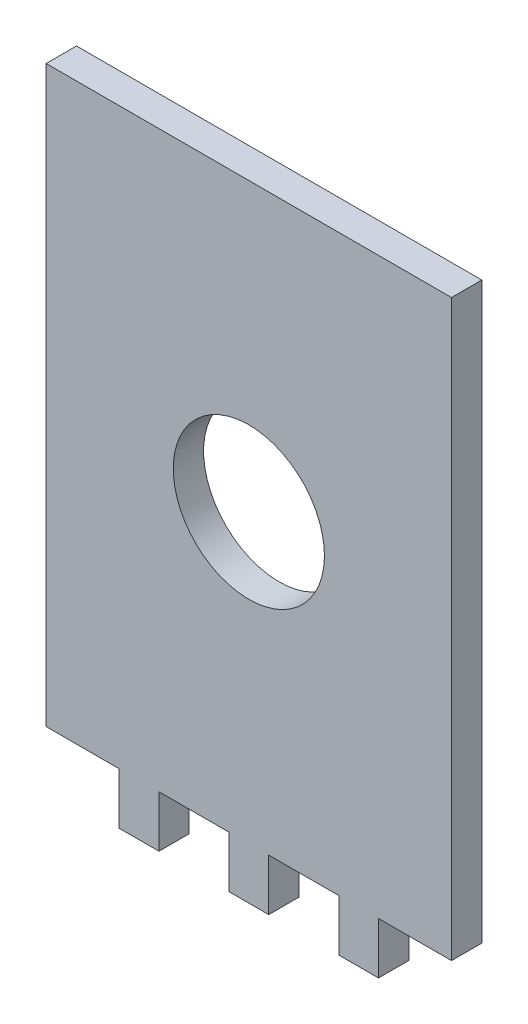
ISO-10303-21;
HEADER;
FILE_DESCRIPTION(('STEP AP214'),'2;1');
FILE_NAME('part.step','',(''),(''),'','','');
FILE_SCHEMA(('AUTOMOTIVE_DESIGN { 1 0 10303 214 1 1 1 1 }'));
ENDSEC;
DATA;
#1=APPLICATION_CONTEXT('core data for automotive mechanical design processes');
#2=APPLICATION_PROTOCOL_DEFINITION('international standard','automotive_design',2000,#1);
#3=PRODUCT_CONTEXT('',#1,'mechanical');
#4=PRODUCT('Part','Part','',(#3));
#5=PRODUCT_RELATED_PRODUCT_CATEGORY('part','',(#4));
#6=PRODUCT_DEFINITION_FORMATION('','',#4);
#7=PRODUCT_DEFINITION_CONTEXT('part definition',#1,'design');
#8=PRODUCT_DEFINITION('design','',#6,#7);
#9=PRODUCT_DEFINITION_SHAPE('','',#8);
#10=(LENGTH_UNIT() NAMED_UNIT(*) SI_UNIT(.MILLI.,.METRE.));
#11=(NAMED_UNIT(*) PLANE_ANGLE_UNIT() SI_UNIT($,.RADIAN.));
#12=(NAMED_UNIT(*) SI_UNIT($,.STERADIAN.) SOLID_ANGLE_UNIT());
#13=UNCERTAINTY_MEASURE_WITH_UNIT(LENGTH_MEASURE(1.E-05),#10,'distance_accuracy_value','');
#14=(GEOMETRIC_REPRESENTATION_CONTEXT(3) GLOBAL_UNCERTAINTY_ASSIGNED_CONTEXT((#13)) GLOBAL_UNIT_ASSIGNED_CONTEXT((#10,
#11,#12)) REPRESENTATION_CONTEXT('',''));
#15=CARTESIAN_POINT('',(0.,0.,0.));
#16=DIRECTION('',(0.,0.,1.));
#17=DIRECTION('',(1.,0.,0.));
#18=AXIS2_PLACEMENT_3D('',#15,#16,#17);
#19=CARTESIAN_POINT('',(0.,0.,-78.1122159172763));
#20=DIRECTION('',(0.,0.,1.));
#21=DIRECTION('',(1.,0.,0.));
#22=AXIS2_PLACEMENT_3D('',#19,#20,#21);
#23=CYLINDRICAL_SURFACE('',#22,7.91872);
#24=CARTESIAN_POINT('',(0.,0.,0.));
#25=DIRECTION('',(0.,0.,1.));
#26=DIRECTION('',(1.,0.,0.));
#27=AXIS2_PLACEMENT_3D('',#24,#25,#26);
#28=CIRCLE('',#27,7.91872);
#29=CARTESIAN_POINT('',(7.91872,0.,0.));
#30=VERTEX_POINT('',#29);
#31=EDGE_CURVE('E11',#30,#30,#28,.F.);
#32=ORIENTED_EDGE('',*,*,#31,.T.);
#33=EDGE_LOOP('',(#32));
#34=FACE_BOUND('',#33,.T.);
#35=CARTESIAN_POINT('',(0.,0.,3.175));
#36=DIRECTION('',(0.,0.,1.));
#37=DIRECTION('',(1.,0.,0.));
#38=AXIS2_PLACEMENT_3D('',#35,#36,#37);
#39=CIRCLE('',#38,7.91872);
#40=CARTESIAN_POINT('',(7.91872,0.,3.175));
#41=VERTEX_POINT('',#40);
#42=EDGE_CURVE('E186',#41,#41,#39,.T.);
#43=ORIENTED_EDGE('',*,*,#42,.T.);
#44=EDGE_LOOP('',(#43));
#45=FACE_BOUND('',#44,.T.);
#46=ADVANCED_FACE('F43',(#34,#45),#23,.F.);
#47=CARTESIAN_POINT('',(0.,0.,0.));
#48=DIRECTION('',(0.,0.,1.));
#49=DIRECTION('',(1.,0.,0.));
#50=AXIS2_PLACEMENT_3D('',#47,#48,#49);
#51=PLANE('',#50);
#52=DIRECTION('',(1.,0.,0.));
#53=VECTOR('',#52,1.);
#54=CARTESIAN_POINT('',(21.23128,30.08128,0.));
#55=LINE('',#54,#53);
#56=CARTESIAN_POINT('',(-21.23128,30.08128,0.));
#57=VERTEX_POINT('',#56);
#58=CARTESIAN_POINT('',(21.23128,30.08128,0.));
#59=VERTEX_POINT('',#58);
#60=EDGE_CURVE('E61',#57,#59,#55,.T.);
#61=ORIENTED_EDGE('',*,*,#60,.T.);
#62=DIRECTION('',(0.,-1.,0.));
#63=VECTOR('',#62,1.);
#64=CARTESIAN_POINT('',(21.23128,-30.08128,0.));
#65=LINE('',#64,#63);
#66=CARTESIAN_POINT('',(21.23128,-30.08128,0.));
#67=VERTEX_POINT('',#66);
#68=EDGE_CURVE('E323',#59,#67,#65,.T.);
#69=ORIENTED_EDGE('',*,*,#68,.T.);
#70=DIRECTION('',(-1.,0.,0.));
#71=VECTOR('',#70,1.);
#72=CARTESIAN_POINT('',(13.58128,-30.08128,0.));
#73=LINE('',#72,#71);
#74=CARTESIAN_POINT('',(13.58128,-30.08128,0.));
#75=VERTEX_POINT('',#74);
#76=EDGE_CURVE('E320',#67,#75,#73,.T.);
#77=ORIENTED_EDGE('',*,*,#76,.T.);
#78=DIRECTION('',(0.,-1.,0.));
#79=VECTOR('',#78,1.);
#80=CARTESIAN_POINT('',(13.5812799999999,-35.48128,0.));
#81=LINE('',#80,#79);
#82=CARTESIAN_POINT('',(13.5812799999999,-35.48128,0.));
#83=VERTEX_POINT('',#82);
#84=EDGE_CURVE('E317',#75,#83,#81,.T.);
#85=ORIENTED_EDGE('',*,*,#84,.T.);
#86=DIRECTION('',(-1.,0.,0.));
#87=VECTOR('',#86,1.);
#88=CARTESIAN_POINT('',(9.41871999999995,-35.48128,0.));
#89=LINE('',#88,#87);
#90=CARTESIAN_POINT('',(9.41871999999995,-35.48128,0.));
#91=VERTEX_POINT('',#90);
#92=EDGE_CURVE('E314',#83,#91,#89,.T.);
#93=ORIENTED_EDGE('',*,*,#92,.T.);
#94=DIRECTION('',(0.,1.,0.));
#95=VECTOR('',#94,1.);
#96=CARTESIAN_POINT('',(9.41871999999995,-30.08128,0.));
#97=LINE('',#96,#95);
#98=CARTESIAN_POINT('',(9.41871999999995,-30.08128,0.));
#99=VERTEX_POINT('',#98);
#100=EDGE_CURVE('E311',#91,#99,#97,.T.);
#101=ORIENTED_EDGE('',*,*,#100,.T.);
#102=DIRECTION('',(-1.,0.,0.));
#103=VECTOR('',#102,1.);
#104=CARTESIAN_POINT('',(2.08127999999995,-30.08128,0.));
#105=LINE('',#104,#103);
#106=CARTESIAN_POINT('',(2.08127999999995,-30.08128,0.));
#107=VERTEX_POINT('',#106);
#108=EDGE_CURVE('E308',#99,#107,#105,.T.);
#109=ORIENTED_EDGE('',*,*,#108,.T.);
#110=DIRECTION('',(0.,-1.,0.));
#111=VECTOR('',#110,1.);
#112=CARTESIAN_POINT('',(2.08127999999995,-35.48128,0.));
#113=LINE('',#112,#111);
#114=CARTESIAN_POINT('',(2.08127999999995,-35.48128,0.));
#115=VERTEX_POINT('',#114);
#116=EDGE_CURVE('E305',#107,#115,#113,.T.);
#117=ORIENTED_EDGE('',*,*,#116,.T.);
#118=DIRECTION('',(-1.,0.,0.));
#119=VECTOR('',#118,1.);
#120=CARTESIAN_POINT('',(-2.08128000000005,-35.48128,0.));
#121=LINE('',#120,#119);
#122=CARTESIAN_POINT('',(-2.08128000000005,-35.48128,0.));
#123=VERTEX_POINT('',#122);
#124=EDGE_CURVE('E302',#115,#123,#121,.T.);
#125=ORIENTED_EDGE('',*,*,#124,.T.);
#126=DIRECTION('',(0.,1.,0.));
#127=VECTOR('',#126,1.);
#128=CARTESIAN_POINT('',(-2.08128000000005,-30.08128,0.));
#129=LINE('',#128,#127);
#130=CARTESIAN_POINT('',(-2.08128000000005,-30.08128,0.));
#131=VERTEX_POINT('',#130);
#132=EDGE_CURVE('E299',#123,#131,#129,.T.);
#133=ORIENTED_EDGE('',*,*,#132,.T.);
#134=DIRECTION('',(-1.,0.,0.));
#135=VECTOR('',#134,1.);
#136=CARTESIAN_POINT('',(-9.41872000000004,-30.08128,0.));
#137=LINE('',#136,#135);
#138=CARTESIAN_POINT('',(-9.41872000000004,-30.08128,0.));
#139=VERTEX_POINT('',#138);
#140=EDGE_CURVE('E296',#131,#139,#137,.T.);
#141=ORIENTED_EDGE('',*,*,#140,.T.);
#142=DIRECTION('',(0.,-1.,0.));
#143=VECTOR('',#142,1.);
#144=CARTESIAN_POINT('',(-9.41872000000005,-35.48128,0.));
#145=LINE('',#144,#143);
#146=CARTESIAN_POINT('',(-9.41872000000005,-35.48128,0.));
#147=VERTEX_POINT('',#146);
#148=EDGE_CURVE('E293',#139,#147,#145,.T.);
#149=ORIENTED_EDGE('',*,*,#148,.T.);
#150=DIRECTION('',(-1.,0.,0.));
#151=VECTOR('',#150,1.);
#152=CARTESIAN_POINT('',(-13.5812800000001,-35.48128,0.));
#153=LINE('',#152,#151);
#154=CARTESIAN_POINT('',(-13.5812800000001,-35.48128,0.));
#155=VERTEX_POINT('',#154);
#156=EDGE_CURVE('E290',#147,#155,#153,.T.);
#157=ORIENTED_EDGE('',*,*,#156,.T.);
#158=DIRECTION('',(0.,1.,0.));
#159=VECTOR('',#158,1.);
#160=CARTESIAN_POINT('',(-13.58128,-30.08128,0.));
#161=LINE('',#160,#159);
#162=CARTESIAN_POINT('',(-13.58128,-30.08128,0.));
#163=VERTEX_POINT('',#162);
#164=EDGE_CURVE('E104',#155,#163,#161,.T.);
#165=ORIENTED_EDGE('',*,*,#164,.T.);
#166=DIRECTION('',(-1.,0.,0.));
#167=VECTOR('',#166,1.);
#168=CARTESIAN_POINT('',(-21.23128,-30.08128,0.));
#169=LINE('',#168,#167);
#170=CARTESIAN_POINT('',(-21.23128,-30.08128,0.));
#171=VERTEX_POINT('',#170);
#172=EDGE_CURVE('E108',#163,#171,#169,.T.);
#173=ORIENTED_EDGE('',*,*,#172,.T.);
#174=DIRECTION('',(0.,1.,0.));
#175=VECTOR('',#174,1.);
#176=CARTESIAN_POINT('',(-21.23128,30.08128,0.));
#177=LINE('',#176,#175);
#178=EDGE_CURVE('E53',#171,#57,#177,.T.);
#179=ORIENTED_EDGE('',*,*,#178,.T.);
#180=EDGE_LOOP('',(#61,#69,#77,#85,#93,#101,#109,#117,#125,#133,#141,#149,#157,#165,#173,#179));
#181=FACE_BOUND('',#180,.T.);
#182=ORIENTED_EDGE('',*,*,#31,.F.);
#183=EDGE_LOOP('',(#182));
#184=FACE_BOUND('',#183,.T.);
#185=ADVANCED_FACE('F45',(#181,#184),#51,.F.);
#186=CARTESIAN_POINT('',(0.,0.,3.175));
#187=DIRECTION('',(0.,0.,1.));
#188=DIRECTION('',(1.,0.,0.));
#189=AXIS2_PLACEMENT_3D('',#186,#187,#188);
#190=PLANE('',#189);
#191=DIRECTION('',(-1.,0.,0.));
#192=VECTOR('',#191,1.);
#193=CARTESIAN_POINT('',(21.23128,30.08128,3.175));
#194=LINE('',#193,#192);
#195=CARTESIAN_POINT('',(21.23128,30.08128,3.175));
#196=VERTEX_POINT('',#195);
#197=CARTESIAN_POINT('',(-21.23128,30.08128,3.175));
#198=VERTEX_POINT('',#197);
#199=EDGE_CURVE('E167',#196,#198,#194,.T.);
#200=ORIENTED_EDGE('',*,*,#199,.T.);
#201=DIRECTION('',(0.,-1.,0.));
#202=VECTOR('',#201,1.);
#203=CARTESIAN_POINT('',(-21.23128,30.08128,3.175));
#204=LINE('',#203,#202);
#205=CARTESIAN_POINT('',(-21.23128,-30.08128,3.175));
#206=VERTEX_POINT('',#205);
#207=EDGE_CURVE('E174',#198,#206,#204,.T.);
#208=ORIENTED_EDGE('',*,*,#207,.T.);
#209=DIRECTION('',(1.,0.,0.));
#210=VECTOR('',#209,1.);
#211=CARTESIAN_POINT('',(-21.23128,-30.08128,3.175));
#212=LINE('',#211,#210);
#213=CARTESIAN_POINT('',(-13.58128,-30.08128,3.175));
#214=VERTEX_POINT('',#213);
#215=EDGE_CURVE('E180',#206,#214,#212,.T.);
#216=ORIENTED_EDGE('',*,*,#215,.T.);
#217=DIRECTION('',(0.,-1.,0.));
#218=VECTOR('',#217,1.);
#219=CARTESIAN_POINT('',(-13.58128,-30.08128,3.175));
#220=LINE('',#219,#218);
#221=CARTESIAN_POINT('',(-13.5812800000001,-35.48128,3.175));
#222=VERTEX_POINT('',#221);
#223=EDGE_CURVE('E195',#214,#222,#220,.T.);
#224=ORIENTED_EDGE('',*,*,#223,.T.);
#225=DIRECTION('',(1.,0.,0.));
#226=VECTOR('',#225,1.);
#227=CARTESIAN_POINT('',(-13.5812800000001,-35.48128,3.175));
#228=LINE('',#227,#226);
#229=CARTESIAN_POINT('',(-9.41872000000005,-35.48128,3.175));
#230=VERTEX_POINT('',#229);
#231=EDGE_CURVE('E199',#222,#230,#228,.T.);
#232=ORIENTED_EDGE('',*,*,#231,.T.);
#233=DIRECTION('',(0.,1.,0.));
#234=VECTOR('',#233,1.);
#235=CARTESIAN_POINT('',(-9.41872000000005,-35.48128,3.175));
#236=LINE('',#235,#234);
#237=CARTESIAN_POINT('',(-9.41872000000004,-30.08128,3.175));
#238=VERTEX_POINT('',#237);
#239=EDGE_CURVE('E203',#230,#238,#236,.T.);
#240=ORIENTED_EDGE('',*,*,#239,.T.);
#241=DIRECTION('',(1.,0.,0.));
#242=VECTOR('',#241,1.);
#243=CARTESIAN_POINT('',(-9.41872000000004,-30.08128,3.175));
#244=LINE('',#243,#242);
#245=CARTESIAN_POINT('',(-2.08128000000005,-30.08128,3.175));
#246=VERTEX_POINT('',#245);
#247=EDGE_CURVE('E207',#238,#246,#244,.T.);
#248=ORIENTED_EDGE('',*,*,#247,.T.);
#249=DIRECTION('',(0.,-1.,0.));
#250=VECTOR('',#249,1.);
#251=CARTESIAN_POINT('',(-2.08128000000005,-30.08128,3.175));
#252=LINE('',#251,#250);
#253=CARTESIAN_POINT('',(-2.08128000000005,-35.48128,3.175));
#254=VERTEX_POINT('',#253);
#255=EDGE_CURVE('E211',#246,#254,#252,.T.);
#256=ORIENTED_EDGE('',*,*,#255,.T.);
#257=DIRECTION('',(1.,0.,0.));
#258=VECTOR('',#257,1.);
#259=CARTESIAN_POINT('',(-2.08128000000005,-35.48128,3.175));
#260=LINE('',#259,#258);
#261=CARTESIAN_POINT('',(2.08127999999995,-35.48128,3.175));
#262=VERTEX_POINT('',#261);
#263=EDGE_CURVE('E215',#254,#262,#260,.T.);
#264=ORIENTED_EDGE('',*,*,#263,.T.);
#265=DIRECTION('',(0.,1.,0.));
#266=VECTOR('',#265,1.);
#267=CARTESIAN_POINT('',(2.08127999999995,-35.48128,3.175));
#268=LINE('',#267,#266);
#269=CARTESIAN_POINT('',(2.08127999999995,-30.08128,3.175));
#270=VERTEX_POINT('',#269);
#271=EDGE_CURVE('E219',#262,#270,#268,.T.);
#272=ORIENTED_EDGE('',*,*,#271,.T.);
#273=DIRECTION('',(1.,0.,0.));
#274=VECTOR('',#273,1.);
#275=CARTESIAN_POINT('',(2.08127999999995,-30.08128,3.175));
#276=LINE('',#275,#274);
#277=CARTESIAN_POINT('',(9.41871999999995,-30.08128,3.175));
#278=VERTEX_POINT('',#277);
#279=EDGE_CURVE('E223',#270,#278,#276,.T.);
#280=ORIENTED_EDGE('',*,*,#279,.T.);
#281=DIRECTION('',(0.,-1.,0.));
#282=VECTOR('',#281,1.);
#283=CARTESIAN_POINT('',(9.41871999999995,-30.08128,3.175));
#284=LINE('',#283,#282);
#285=CARTESIAN_POINT('',(9.41871999999995,-35.48128,3.175));
#286=VERTEX_POINT('',#285);
#287=EDGE_CURVE('E227',#278,#286,#284,.T.);
#288=ORIENTED_EDGE('',*,*,#287,.T.);
#289=DIRECTION('',(1.,0.,0.));
#290=VECTOR('',#289,1.);
#291=CARTESIAN_POINT('',(9.41871999999995,-35.48128,3.175));
#292=LINE('',#291,#290);
#293=CARTESIAN_POINT('',(13.5812799999999,-35.48128,3.175));
#294=VERTEX_POINT('',#293);
#295=EDGE_CURVE('E231',#286,#294,#292,.T.);
#296=ORIENTED_EDGE('',*,*,#295,.T.);
#297=DIRECTION('',(0.,1.,0.));
#298=VECTOR('',#297,1.);
#299=CARTESIAN_POINT('',(13.5812799999999,-35.48128,3.175));
#300=LINE('',#299,#298);
#301=CARTESIAN_POINT('',(13.58128,-30.08128,3.175));
#302=VERTEX_POINT('',#301);
#303=EDGE_CURVE('E235',#294,#302,#300,.T.);
#304=ORIENTED_EDGE('',*,*,#303,.T.);
#305=DIRECTION('',(1.,0.,0.));
#306=VECTOR('',#305,1.);
#307=CARTESIAN_POINT('',(13.58128,-30.08128,3.175));
#308=LINE('',#307,#306);
#309=CARTESIAN_POINT('',(21.23128,-30.08128,3.175));
#310=VERTEX_POINT('',#309);
#311=EDGE_CURVE('E239',#302,#310,#308,.T.);
#312=ORIENTED_EDGE('',*,*,#311,.T.);
#313=DIRECTION('',(0.,1.,0.));
#314=VECTOR('',#313,1.);
#315=CARTESIAN_POINT('',(21.23128,-30.08128,3.175));
#316=LINE('',#315,#314);
#317=EDGE_CURVE('E172',#310,#196,#316,.T.);
#318=ORIENTED_EDGE('',*,*,#317,.T.);
#319=EDGE_LOOP('',(#200,#208,#216,#224,#232,#240,#248,#256,#264,#272,#280,#288,#296,#304,#312,#318));
#320=FACE_BOUND('',#319,.T.);
#321=ORIENTED_EDGE('',*,*,#42,.F.);
#322=EDGE_LOOP('',(#321));
#323=FACE_BOUND('',#322,.T.);
#324=ADVANCED_FACE('F182',(#320,#323),#190,.T.);
#325=CARTESIAN_POINT('',(-21.23128,30.08128,-78.1122159172763));
#326=DIRECTION('',(-1.,0.,0.));
#327=DIRECTION('',(0.,-1.,0.));
#328=AXIS2_PLACEMENT_3D('',#325,#326,#327);
#329=PLANE('',#328);
#330=ORIENTED_EDGE('',*,*,#178,.F.);
#331=DIRECTION('',(0.,0.,1.));
#332=VECTOR('',#331,1.);
#333=CARTESIAN_POINT('',(-21.23128,-30.08128,-78.1122159172763));
#334=LINE('',#333,#332);
#335=EDGE_CURVE('E171',#171,#206,#334,.T.);
#336=ORIENTED_EDGE('',*,*,#335,.T.);
#337=ORIENTED_EDGE('',*,*,#207,.F.);
#338=DIRECTION('',(0.,0.,1.));
#339=VECTOR('',#338,1.);
#340=CARTESIAN_POINT('',(-21.23128,30.08128,-78.1122159172763));
#341=LINE('',#340,#339);
#342=EDGE_CURVE('E163',#57,#198,#341,.T.);
#343=ORIENTED_EDGE('',*,*,#342,.F.);
#344=EDGE_LOOP('',(#330,#336,#337,#343));
#345=FACE_BOUND('',#344,.T.);
#346=ADVANCED_FACE('F175',(#345),#329,.T.);
#347=CARTESIAN_POINT('',(-21.23128,-30.08128,-78.1122159172763));
#348=DIRECTION('',(0.,-1.,0.));
#349=DIRECTION('',(0.,0.,-1.));
#350=AXIS2_PLACEMENT_3D('',#347,#348,#349);
#351=PLANE('',#350);
#352=ORIENTED_EDGE('',*,*,#172,.F.);
#353=DIRECTION('',(0.,0.,1.));
#354=VECTOR('',#353,1.);
#355=CARTESIAN_POINT('',(-13.58128,-30.08128,-78.1122159172763));
#356=LINE('',#355,#354);
#357=EDGE_CURVE('E282',#163,#214,#356,.T.);
#358=ORIENTED_EDGE('',*,*,#357,.T.);
#359=ORIENTED_EDGE('',*,*,#215,.F.);
#360=ORIENTED_EDGE('',*,*,#335,.F.);
#361=EDGE_LOOP('',(#352,#358,#359,#360));
#362=FACE_BOUND('',#361,.T.);
#363=ADVANCED_FACE('F360',(#362),#351,.T.);
#364=CARTESIAN_POINT('',(-13.58128,-30.08128,-78.1122159172763));
#365=DIRECTION('',(-1.,0.,0.));
#366=DIRECTION('',(0.,-1.,0.));
#367=AXIS2_PLACEMENT_3D('',#364,#365,#366);
#368=PLANE('',#367);
#369=ORIENTED_EDGE('',*,*,#164,.F.);
#370=DIRECTION('',(0.,0.,1.));
#371=VECTOR('',#370,1.);
#372=CARTESIAN_POINT('',(-13.5812800000001,-35.48128,-78.1122159172763));
#373=LINE('',#372,#371);
#374=EDGE_CURVE('E279',#155,#222,#373,.T.);
#375=ORIENTED_EDGE('',*,*,#374,.T.);
#376=ORIENTED_EDGE('',*,*,#223,.F.);
#377=ORIENTED_EDGE('',*,*,#357,.F.);
#378=EDGE_LOOP('',(#369,#375,#376,#377));
#379=FACE_BOUND('',#378,.T.);
#380=ADVANCED_FACE('F365',(#379),#368,.T.);
#381=CARTESIAN_POINT('',(-13.5812800000001,-35.48128,-78.1122159172763));
#382=DIRECTION('',(0.,-1.,0.));
#383=DIRECTION('',(0.,0.,-1.));
#384=AXIS2_PLACEMENT_3D('',#381,#382,#383);
#385=PLANE('',#384);
#386=ORIENTED_EDGE('',*,*,#156,.F.);
#387=DIRECTION('',(0.,0.,1.));
#388=VECTOR('',#387,1.);
#389=CARTESIAN_POINT('',(-9.41872000000005,-35.48128,-78.1122159172763));
#390=LINE('',#389,#388);
#391=EDGE_CURVE('E276',#147,#230,#390,.T.);
#392=ORIENTED_EDGE('',*,*,#391,.T.);
#393=ORIENTED_EDGE('',*,*,#231,.F.);
#394=ORIENTED_EDGE('',*,*,#374,.F.);
#395=EDGE_LOOP('',(#386,#392,#393,#394));
#396=FACE_BOUND('',#395,.T.);
#397=ADVANCED_FACE('F369',(#396),#385,.T.);
#398=CARTESIAN_POINT('',(-9.41872000000005,-35.48128,-78.1122159172763));
#399=DIRECTION('',(1.,0.,0.));
#400=DIRECTION('',(0.,1.,0.));
#401=AXIS2_PLACEMENT_3D('',#398,#399,#400);
#402=PLANE('',#401);
#403=ORIENTED_EDGE('',*,*,#148,.F.);
#404=DIRECTION('',(0.,0.,1.));
#405=VECTOR('',#404,1.);
#406=CARTESIAN_POINT('',(-9.41872000000004,-30.08128,-78.1122159172763));
#407=LINE('',#406,#405);
#408=EDGE_CURVE('E273',#139,#238,#407,.T.);
#409=ORIENTED_EDGE('',*,*,#408,.T.);
#410=ORIENTED_EDGE('',*,*,#239,.F.);
#411=ORIENTED_EDGE('',*,*,#391,.F.);
#412=EDGE_LOOP('',(#403,#409,#410,#411));
#413=FACE_BOUND('',#412,.T.);
#414=ADVANCED_FACE('F373',(#413),#402,.T.);
#415=CARTESIAN_POINT('',(-9.41872000000004,-30.08128,-78.1122159172763));
#416=DIRECTION('',(0.,-1.,0.));
#417=DIRECTION('',(0.,0.,-1.));
#418=AXIS2_PLACEMENT_3D('',#415,#416,#417);
#419=PLANE('',#418);
#420=ORIENTED_EDGE('',*,*,#140,.F.);
#421=DIRECTION('',(0.,0.,1.));
#422=VECTOR('',#421,1.);
#423=CARTESIAN_POINT('',(-2.08128000000005,-30.08128,-78.1122159172763));
#424=LINE('',#423,#422);
#425=EDGE_CURVE('E270',#131,#246,#424,.T.);
#426=ORIENTED_EDGE('',*,*,#425,.T.);
#427=ORIENTED_EDGE('',*,*,#247,.F.);
#428=ORIENTED_EDGE('',*,*,#408,.F.);
#429=EDGE_LOOP('',(#420,#426,#427,#428));
#430=FACE_BOUND('',#429,.T.);
#431=ADVANCED_FACE('F377',(#430),#419,.T.);
#432=CARTESIAN_POINT('',(-2.08128000000005,-30.08128,-78.1122159172763));
#433=DIRECTION('',(-1.,0.,0.));
#434=DIRECTION('',(0.,-1.,0.));
#435=AXIS2_PLACEMENT_3D('',#432,#433,#434);
#436=PLANE('',#435);
#437=ORIENTED_EDGE('',*,*,#132,.F.);
#438=DIRECTION('',(0.,0.,1.));
#439=VECTOR('',#438,1.);
#440=CARTESIAN_POINT('',(-2.08128000000005,-35.48128,-78.1122159172763));
#441=LINE('',#440,#439);
#442=EDGE_CURVE('E267',#123,#254,#441,.T.);
#443=ORIENTED_EDGE('',*,*,#442,.T.);
#444=ORIENTED_EDGE('',*,*,#255,.F.);
#445=ORIENTED_EDGE('',*,*,#425,.F.);
#446=EDGE_LOOP('',(#437,#443,#444,#445));
#447=FACE_BOUND('',#446,.T.);
#448=ADVANCED_FACE('F381',(#447),#436,.T.);
#449=CARTESIAN_POINT('',(-2.08128000000005,-35.48128,-78.1122159172763));
#450=DIRECTION('',(0.,-1.,0.));
#451=DIRECTION('',(0.,0.,-1.));
#452=AXIS2_PLACEMENT_3D('',#449,#450,#451);
#453=PLANE('',#452);
#454=ORIENTED_EDGE('',*,*,#124,.F.);
#455=DIRECTION('',(0.,0.,1.));
#456=VECTOR('',#455,1.);
#457=CARTESIAN_POINT('',(2.08127999999995,-35.48128,-78.1122159172763));
#458=LINE('',#457,#456);
#459=EDGE_CURVE('E264',#115,#262,#458,.T.);
#460=ORIENTED_EDGE('',*,*,#459,.T.);
#461=ORIENTED_EDGE('',*,*,#263,.F.);
#462=ORIENTED_EDGE('',*,*,#442,.F.);
#463=EDGE_LOOP('',(#454,#460,#461,#462));
#464=FACE_BOUND('',#463,.T.);
#465=ADVANCED_FACE('F385',(#464),#453,.T.);
#466=CARTESIAN_POINT('',(2.08127999999995,-35.48128,-78.1122159172763));
#467=DIRECTION('',(1.,0.,0.));
#468=DIRECTION('',(0.,1.,0.));
#469=AXIS2_PLACEMENT_3D('',#466,#467,#468);
#470=PLANE('',#469);
#471=ORIENTED_EDGE('',*,*,#116,.F.);
#472=DIRECTION('',(0.,0.,1.));
#473=VECTOR('',#472,1.);
#474=CARTESIAN_POINT('',(2.08127999999995,-30.08128,-78.1122159172763));
#475=LINE('',#474,#473);
#476=EDGE_CURVE('E261',#107,#270,#475,.T.);
#477=ORIENTED_EDGE('',*,*,#476,.T.);
#478=ORIENTED_EDGE('',*,*,#271,.F.);
#479=ORIENTED_EDGE('',*,*,#459,.F.);
#480=EDGE_LOOP('',(#471,#477,#478,#479));
#481=FACE_BOUND('',#480,.T.);
#482=ADVANCED_FACE('F389',(#481),#470,.T.);
#483=CARTESIAN_POINT('',(2.08127999999995,-30.08128,-78.1122159172763));
#484=DIRECTION('',(0.,-1.,0.));
#485=DIRECTION('',(0.,0.,-1.));
#486=AXIS2_PLACEMENT_3D('',#483,#484,#485);
#487=PLANE('',#486);
#488=ORIENTED_EDGE('',*,*,#108,.F.);
#489=DIRECTION('',(0.,0.,1.));
#490=VECTOR('',#489,1.);
#491=CARTESIAN_POINT('',(9.41871999999995,-30.08128,-78.1122159172763));
#492=LINE('',#491,#490);
#493=EDGE_CURVE('E258',#99,#278,#492,.T.);
#494=ORIENTED_EDGE('',*,*,#493,.T.);
#495=ORIENTED_EDGE('',*,*,#279,.F.);
#496=ORIENTED_EDGE('',*,*,#476,.F.);
#497=EDGE_LOOP('',(#488,#494,#495,#496));
#498=FACE_BOUND('',#497,.T.);
#499=ADVANCED_FACE('F393',(#498),#487,.T.);
#500=CARTESIAN_POINT('',(9.41871999999995,-30.08128,-78.1122159172763));
#501=DIRECTION('',(-1.,0.,0.));
#502=DIRECTION('',(0.,-1.,0.));
#503=AXIS2_PLACEMENT_3D('',#500,#501,#502);
#504=PLANE('',#503);
#505=ORIENTED_EDGE('',*,*,#100,.F.);
#506=DIRECTION('',(0.,0.,1.));
#507=VECTOR('',#506,1.);
#508=CARTESIAN_POINT('',(9.41871999999995,-35.48128,-78.1122159172763));
#509=LINE('',#508,#507);
#510=EDGE_CURVE('E255',#91,#286,#509,.T.);
#511=ORIENTED_EDGE('',*,*,#510,.T.);
#512=ORIENTED_EDGE('',*,*,#287,.F.);
#513=ORIENTED_EDGE('',*,*,#493,.F.);
#514=EDGE_LOOP('',(#505,#511,#512,#513));
#515=FACE_BOUND('',#514,.T.);
#516=ADVANCED_FACE('F397',(#515),#504,.T.);
#517=CARTESIAN_POINT('',(9.41871999999995,-35.48128,-78.1122159172763));
#518=DIRECTION('',(0.,-1.,0.));
#519=DIRECTION('',(0.,0.,-1.));
#520=AXIS2_PLACEMENT_3D('',#517,#518,#519);
#521=PLANE('',#520);
#522=ORIENTED_EDGE('',*,*,#92,.F.);
#523=DIRECTION('',(0.,0.,1.));
#524=VECTOR('',#523,1.);
#525=CARTESIAN_POINT('',(13.5812799999999,-35.48128,-78.1122159172763));
#526=LINE('',#525,#524);
#527=EDGE_CURVE('E252',#83,#294,#526,.T.);
#528=ORIENTED_EDGE('',*,*,#527,.T.);
#529=ORIENTED_EDGE('',*,*,#295,.F.);
#530=ORIENTED_EDGE('',*,*,#510,.F.);
#531=EDGE_LOOP('',(#522,#528,#529,#530));
#532=FACE_BOUND('',#531,.T.);
#533=ADVANCED_FACE('F401',(#532),#521,.T.);
#534=CARTESIAN_POINT('',(13.5812799999999,-35.48128,-78.1122159172763));
#535=DIRECTION('',(1.,0.,0.));
#536=DIRECTION('',(0.,1.,0.));
#537=AXIS2_PLACEMENT_3D('',#534,#535,#536);
#538=PLANE('',#537);
#539=ORIENTED_EDGE('',*,*,#84,.F.);
#540=DIRECTION('',(0.,0.,1.));
#541=VECTOR('',#540,1.);
#542=CARTESIAN_POINT('',(13.58128,-30.08128,-78.1122159172763));
#543=LINE('',#542,#541);
#544=EDGE_CURVE('E249',#75,#302,#543,.T.);
#545=ORIENTED_EDGE('',*,*,#544,.T.);
#546=ORIENTED_EDGE('',*,*,#303,.F.);
#547=ORIENTED_EDGE('',*,*,#527,.F.);
#548=EDGE_LOOP('',(#539,#545,#546,#547));
#549=FACE_BOUND('',#548,.T.);
#550=ADVANCED_FACE('F345',(#549),#538,.T.);
#551=CARTESIAN_POINT('',(13.58128,-30.08128,-78.1122159172763));
#552=DIRECTION('',(0.,-1.,0.));
#553=DIRECTION('',(0.,0.,-1.));
#554=AXIS2_PLACEMENT_3D('',#551,#552,#553);
#555=PLANE('',#554);
#556=ORIENTED_EDGE('',*,*,#76,.F.);
#557=DIRECTION('',(0.,0.,1.));
#558=VECTOR('',#557,1.);
#559=CARTESIAN_POINT('',(21.23128,-30.08128,-78.1122159172763));
#560=LINE('',#559,#558);
#561=EDGE_CURVE('E246',#67,#310,#560,.T.);
#562=ORIENTED_EDGE('',*,*,#561,.T.);
#563=ORIENTED_EDGE('',*,*,#311,.F.);
#564=ORIENTED_EDGE('',*,*,#544,.F.);
#565=EDGE_LOOP('',(#556,#562,#563,#564));
#566=FACE_BOUND('',#565,.T.);
#567=ADVANCED_FACE('F335',(#566),#555,.T.);
#568=CARTESIAN_POINT('',(21.23128,-30.08128,-78.1122159172763));
#569=DIRECTION('',(1.,0.,0.));
#570=DIRECTION('',(0.,0.,-1.));
#571=AXIS2_PLACEMENT_3D('',#568,#569,#570);
#572=PLANE('',#571);
#573=ORIENTED_EDGE('',*,*,#68,.F.);
#574=DIRECTION('',(0.,0.,1.));
#575=VECTOR('',#574,1.);
#576=CARTESIAN_POINT('',(21.23128,30.08128,-78.1122159172763));
#577=LINE('',#576,#575);
#578=EDGE_CURVE('E115',#59,#196,#577,.T.);
#579=ORIENTED_EDGE('',*,*,#578,.T.);
#580=ORIENTED_EDGE('',*,*,#317,.F.);
#581=ORIENTED_EDGE('',*,*,#561,.F.);
#582=EDGE_LOOP('',(#573,#579,#580,#581));
#583=FACE_BOUND('',#582,.T.);
#584=ADVANCED_FACE('F337',(#583),#572,.T.);
#585=CARTESIAN_POINT('',(21.23128,30.08128,-78.1122159172763));
#586=DIRECTION('',(0.,1.,0.));
#587=DIRECTION('',(0.,0.,1.));
#588=AXIS2_PLACEMENT_3D('',#585,#586,#587);
#589=PLANE('',#588);
#590=ORIENTED_EDGE('',*,*,#60,.F.);
#591=ORIENTED_EDGE('',*,*,#342,.T.);
#592=ORIENTED_EDGE('',*,*,#199,.F.);
#593=ORIENTED_EDGE('',*,*,#578,.F.);
#594=EDGE_LOOP('',(#590,#591,#592,#593));
#595=FACE_BOUND('',#594,.T.);
#596=ADVANCED_FACE('F165',(#595),#589,.T.);
#597=CLOSED_SHELL('',(#46,#185,#324,#346,#363,#380,#397,#414,#431,#448,#465,#482,#499,#516,#533,
#550,#567,#584,#596));
#598=MANIFOLD_SOLID_BREP('B2',#597);
#599=ADVANCED_BREP_SHAPE_REPRESENTATION('',(#18,#598),#14);
#600=SHAPE_DEFINITION_REPRESENTATION(#9,#599);
ENDSEC;
END-ISO-10303-21;
